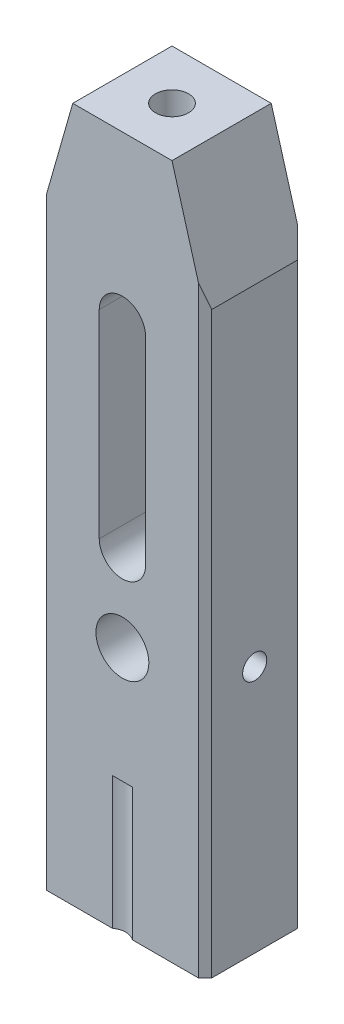
ISO-10303-21;
HEADER;
FILE_DESCRIPTION(('STEP AP214'),'2;1');
FILE_NAME('part.step','',(''),(''),'','','');
FILE_SCHEMA(('AUTOMOTIVE_DESIGN { 1 0 10303 214 1 1 1 1 }'));
ENDSEC;
DATA;
#1=APPLICATION_CONTEXT('core data for automotive mechanical design processes');
#2=APPLICATION_PROTOCOL_DEFINITION('international standard','automotive_design',2000,#1);
#3=PRODUCT_CONTEXT('',#1,'mechanical');
#4=PRODUCT('Part','Part','',(#3));
#5=PRODUCT_RELATED_PRODUCT_CATEGORY('part','',(#4));
#6=PRODUCT_DEFINITION_FORMATION('','',#4);
#7=PRODUCT_DEFINITION_CONTEXT('part definition',#1,'design');
#8=PRODUCT_DEFINITION('design','',#6,#7);
#9=PRODUCT_DEFINITION_SHAPE('','',#8);
#10=(LENGTH_UNIT() NAMED_UNIT(*) SI_UNIT(.MILLI.,.METRE.));
#11=(NAMED_UNIT(*) PLANE_ANGLE_UNIT() SI_UNIT($,.RADIAN.));
#12=(NAMED_UNIT(*) SI_UNIT($,.STERADIAN.) SOLID_ANGLE_UNIT());
#13=UNCERTAINTY_MEASURE_WITH_UNIT(LENGTH_MEASURE(1.E-05),#10,'distance_accuracy_value','');
#14=(GEOMETRIC_REPRESENTATION_CONTEXT(3) GLOBAL_UNCERTAINTY_ASSIGNED_CONTEXT((#13)) GLOBAL_UNIT_ASSIGNED_CONTEXT((#10,
#11,#12)) REPRESENTATION_CONTEXT('',''));
#15=CARTESIAN_POINT('',(0.,0.,0.));
#16=DIRECTION('',(0.,0.,1.));
#17=DIRECTION('',(1.,0.,0.));
#18=AXIS2_PLACEMENT_3D('',#15,#16,#17);
#19=CARTESIAN_POINT('',(0.,210.,0.));
#20=DIRECTION('',(0.,0.,-1.));
#21=DIRECTION('',(-1.,0.,0.));
#22=AXIS2_PLACEMENT_3D('',#19,#20,#21);
#23=PLANE('',#22);
#24=DIRECTION('',(0.,-1.,0.));
#25=VECTOR('',#24,1.);
#26=CARTESIAN_POINT('',(18.,160.,0.));
#27=LINE('',#26,#25);
#28=CARTESIAN_POINT('',(18.,160.,0.));
#29=VERTEX_POINT('',#28);
#30=CARTESIAN_POINT('',(18.,100.,0.));
#31=VERTEX_POINT('',#30);
#32=EDGE_CURVE('E206',#29,#31,#27,.T.);
#33=ORIENTED_EDGE('',*,*,#32,.F.);
#34=CARTESIAN_POINT('',(25.,160.,0.));
#35=DIRECTION('',(0.,0.,-1.));
#36=DIRECTION('',(-1.,0.,0.));
#37=AXIS2_PLACEMENT_3D('',#34,#35,#36);
#38=CIRCLE('',#37,7.);
#39=CARTESIAN_POINT('',(32.,160.,0.));
#40=VERTEX_POINT('',#39);
#41=EDGE_CURVE('E209',#40,#29,#38,.F.);
#42=ORIENTED_EDGE('',*,*,#41,.F.);
#43=DIRECTION('',(0.,1.,0.));
#44=VECTOR('',#43,1.);
#45=CARTESIAN_POINT('',(32.,160.,0.));
#46=LINE('',#45,#44);
#47=CARTESIAN_POINT('',(32.,100.,0.));
#48=VERTEX_POINT('',#47);
#49=EDGE_CURVE('E226',#48,#40,#46,.T.);
#50=ORIENTED_EDGE('',*,*,#49,.F.);
#51=CARTESIAN_POINT('',(25.,100.,0.));
#52=DIRECTION('',(0.,0.,-1.));
#53=DIRECTION('',(-1.,0.,0.));
#54=AXIS2_PLACEMENT_3D('',#51,#52,#53);
#55=CIRCLE('',#54,7.);
#56=EDGE_CURVE('E191',#31,#48,#55,.F.);
#57=ORIENTED_EDGE('',*,*,#56,.F.);
#58=EDGE_LOOP('',(#33,#42,#50,#57));
#59=FACE_BOUND('',#58,.T.);
#60=CARTESIAN_POINT('',(25.,75.,0.));
#61=DIRECTION('',(0.,0.,1.));
#62=DIRECTION('',(1.,0.,0.));
#63=AXIS2_PLACEMENT_3D('',#60,#61,#62);
#64=CIRCLE('',#63,8.);
#65=CARTESIAN_POINT('',(33.,75.,0.));
#66=VERTEX_POINT('',#65);
#67=EDGE_CURVE('E246',#66,#66,#64,.T.);
#68=ORIENTED_EDGE('',*,*,#67,.F.);
#69=EDGE_LOOP('',(#68));
#70=FACE_BOUND('',#69,.T.);
#71=DIRECTION('',(-1.,0.,0.));
#72=VECTOR('',#71,1.);
#73=CARTESIAN_POINT('',(22.,40.,0.));
#74=LINE('',#73,#72);
#75=CARTESIAN_POINT('',(28.,40.,0.));
#76=VERTEX_POINT('',#75);
#77=CARTESIAN_POINT('',(22.,40.,0.));
#78=VERTEX_POINT('',#77);
#79=EDGE_CURVE('E181',#76,#78,#74,.T.);
#80=ORIENTED_EDGE('',*,*,#79,.F.);
#81=DIRECTION('',(0.,-1.,0.));
#82=VECTOR('',#81,1.);
#83=CARTESIAN_POINT('',(28.,40.,0.));
#84=LINE('',#83,#82);
#85=CARTESIAN_POINT('',(28.,0.,0.));
#86=VERTEX_POINT('',#85);
#87=EDGE_CURVE('E172',#76,#86,#84,.T.);
#88=ORIENTED_EDGE('',*,*,#87,.T.);
#89=DIRECTION('',(1.,0.,0.));
#90=VECTOR('',#89,1.);
#91=CARTESIAN_POINT('',(0.,0.,0.));
#92=LINE('',#91,#90);
#93=CARTESIAN_POINT('',(48.,0.,0.));
#94=VERTEX_POINT('',#93);
#95=EDGE_CURVE('E274',#86,#94,#92,.T.);
#96=ORIENTED_EDGE('',*,*,#95,.T.);
#97=DIRECTION('',(0.,1.,0.));
#98=VECTOR('',#97,1.);
#99=CARTESIAN_POINT('',(48.,210.,0.));
#100=LINE('',#99,#98);
#101=CARTESIAN_POINT('',(48.,182.,0.));
#102=VERTEX_POINT('',#101);
#103=EDGE_CURVE('E11',#94,#102,#100,.T.);
#104=ORIENTED_EDGE('',*,*,#103,.T.);
#105=DIRECTION('',(-0.274721127897378,0.961523947640823,0.));
#106=VECTOR('',#105,1.);
#107=CARTESIAN_POINT('',(50.,175.,0.));
#108=LINE('',#107,#106);
#109=CARTESIAN_POINT('',(40.,210.,0.));
#110=VERTEX_POINT('',#109);
#111=EDGE_CURVE('E240',#102,#110,#108,.T.);
#112=ORIENTED_EDGE('',*,*,#111,.T.);
#113=DIRECTION('',(1.,0.,0.));
#114=VECTOR('',#113,1.);
#115=CARTESIAN_POINT('',(0.,210.,0.));
#116=LINE('',#115,#114);
#117=CARTESIAN_POINT('',(9.99999999999997,210.,0.));
#118=VERTEX_POINT('',#117);
#119=EDGE_CURVE('E264',#118,#110,#116,.T.);
#120=ORIENTED_EDGE('',*,*,#119,.F.);
#121=DIRECTION('',(0.274721127897377,0.961523947640823,0.));
#122=VECTOR('',#121,1.);
#123=CARTESIAN_POINT('',(0.,175.,0.));
#124=LINE('',#123,#122);
#125=CARTESIAN_POINT('',(2.00000000000003,182.,0.));
#126=VERTEX_POINT('',#125);
#127=EDGE_CURVE('E239',#126,#118,#124,.T.);
#128=ORIENTED_EDGE('',*,*,#127,.F.);
#129=DIRECTION('',(0.,-1.,0.));
#130=VECTOR('',#129,1.);
#131=CARTESIAN_POINT('',(2.00000000000003,210.,0.));
#132=LINE('',#131,#130);
#133=CARTESIAN_POINT('',(2.00000000000003,0.,0.));
#134=VERTEX_POINT('',#133);
#135=EDGE_CURVE('E57',#126,#134,#132,.T.);
#136=ORIENTED_EDGE('',*,*,#135,.T.);
#137=CARTESIAN_POINT('',(22.,0.,0.));
#138=VERTEX_POINT('',#137);
#139=EDGE_CURVE('E275',#134,#138,#92,.T.);
#140=ORIENTED_EDGE('',*,*,#139,.T.);
#141=DIRECTION('',(0.,-1.,0.));
#142=VECTOR('',#141,1.);
#143=CARTESIAN_POINT('',(22.,40.,0.));
#144=LINE('',#143,#142);
#145=EDGE_CURVE('E65',#78,#138,#144,.T.);
#146=ORIENTED_EDGE('',*,*,#145,.F.);
#147=EDGE_LOOP('',(#80,#88,#96,#104,#112,#120,#128,#136,#140,#146));
#148=FACE_BOUND('',#147,.T.);
#149=ADVANCED_FACE('F42',(#59,#70,#148),#23,.F.);
#150=CARTESIAN_POINT('',(50.,210.,0.));
#151=DIRECTION('',(-1.,0.,0.));
#152=DIRECTION('',(0.,0.,1.));
#153=AXIS2_PLACEMENT_3D('',#150,#151,#152);
#154=PLANE('',#153);
#155=CARTESIAN_POINT('',(50.,75.,-15.));
#156=DIRECTION('',(1.,0.,0.));
#157=DIRECTION('',(0.,0.,-1.));
#158=AXIS2_PLACEMENT_3D('',#155,#156,#157);
#159=CIRCLE('',#158,3.65);
#160=CARTESIAN_POINT('',(50.,75.,-18.65));
#161=VERTEX_POINT('',#160);
#162=EDGE_CURVE('E477',#161,#161,#159,.T.);
#163=ORIENTED_EDGE('',*,*,#162,.F.);
#164=EDGE_LOOP('',(#163));
#165=FACE_BOUND('',#164,.T.);
#166=DIRECTION('',(0.,0.,-1.));
#167=VECTOR('',#166,1.);
#168=CARTESIAN_POINT('',(50.,0.,0.));
#169=LINE('',#168,#167);
#170=CARTESIAN_POINT('',(50.,0.,-2.00000000000003));
#171=VERTEX_POINT('',#170);
#172=CARTESIAN_POINT('',(50.,0.,-28.));
#173=VERTEX_POINT('',#172);
#174=EDGE_CURVE('E277',#171,#173,#169,.T.);
#175=ORIENTED_EDGE('',*,*,#174,.T.);
#176=DIRECTION('',(0.,1.,0.));
#177=VECTOR('',#176,1.);
#178=CARTESIAN_POINT('',(50.,210.,-28.));
#179=LINE('',#178,#177);
#180=CARTESIAN_POINT('',(50.,175.,-28.));
#181=VERTEX_POINT('',#180);
#182=EDGE_CURVE('E309',#173,#181,#179,.T.);
#183=ORIENTED_EDGE('',*,*,#182,.T.);
#184=DIRECTION('',(0.,0.,1.));
#185=VECTOR('',#184,1.);
#186=CARTESIAN_POINT('',(50.,175.,-30.001));
#187=LINE('',#186,#185);
#188=CARTESIAN_POINT('',(50.,175.,-2.00000000000003));
#189=VERTEX_POINT('',#188);
#190=EDGE_CURVE('E251',#181,#189,#187,.T.);
#191=ORIENTED_EDGE('',*,*,#190,.T.);
#192=DIRECTION('',(0.,-1.,0.));
#193=VECTOR('',#192,1.);
#194=CARTESIAN_POINT('',(50.,210.,-2.00000000000003));
#195=LINE('',#194,#193);
#196=EDGE_CURVE('E306',#189,#171,#195,.T.);
#197=ORIENTED_EDGE('',*,*,#196,.T.);
#198=EDGE_LOOP('',(#175,#183,#191,#197));
#199=FACE_BOUND('',#198,.T.);
#200=ADVANCED_FACE('F377',(#165,#199),#154,.F.);
#201=CARTESIAN_POINT('',(0.,210.,-30.));
#202=DIRECTION('',(0.,0.,1.));
#203=DIRECTION('',(1.,0.,0.));
#204=AXIS2_PLACEMENT_3D('',#201,#202,#203);
#205=PLANE('',#204);
#206=DIRECTION('',(0.,-1.,0.));
#207=VECTOR('',#206,1.);
#208=CARTESIAN_POINT('',(32.,160.,-30.));
#209=LINE('',#208,#207);
#210=CARTESIAN_POINT('',(32.,160.,-30.));
#211=VERTEX_POINT('',#210);
#212=CARTESIAN_POINT('',(32.,100.,-30.));
#213=VERTEX_POINT('',#212);
#214=EDGE_CURVE('E214',#211,#213,#209,.T.);
#215=ORIENTED_EDGE('',*,*,#214,.F.);
#216=CARTESIAN_POINT('',(25.,160.,-30.));
#217=DIRECTION('',(0.,0.,-1.));
#218=DIRECTION('',(-1.,0.,0.));
#219=AXIS2_PLACEMENT_3D('',#216,#217,#218);
#220=CIRCLE('',#219,7.);
#221=CARTESIAN_POINT('',(18.,160.,-30.));
#222=VERTEX_POINT('',#221);
#223=EDGE_CURVE('E212',#222,#211,#220,.T.);
#224=ORIENTED_EDGE('',*,*,#223,.F.);
#225=DIRECTION('',(0.,1.,0.));
#226=VECTOR('',#225,1.);
#227=CARTESIAN_POINT('',(18.,160.,-30.));
#228=LINE('',#227,#226);
#229=CARTESIAN_POINT('',(18.,100.,-30.));
#230=VERTEX_POINT('',#229);
#231=EDGE_CURVE('E220',#230,#222,#228,.T.);
#232=ORIENTED_EDGE('',*,*,#231,.F.);
#233=CARTESIAN_POINT('',(25.,100.,-30.));
#234=DIRECTION('',(0.,0.,-1.));
#235=DIRECTION('',(-1.,0.,0.));
#236=AXIS2_PLACEMENT_3D('',#233,#234,#235);
#237=CIRCLE('',#236,7.);
#238=EDGE_CURVE('E217',#213,#230,#237,.T.);
#239=ORIENTED_EDGE('',*,*,#238,.F.);
#240=EDGE_LOOP('',(#215,#224,#232,#239));
#241=FACE_BOUND('',#240,.T.);
#242=CARTESIAN_POINT('',(25.,75.,-30.));
#243=DIRECTION('',(0.,0.,1.));
#244=DIRECTION('',(1.,0.,0.));
#245=AXIS2_PLACEMENT_3D('',#242,#243,#244);
#246=CIRCLE('',#245,8.);
#247=CARTESIAN_POINT('',(33.,75.,-30.));
#248=VERTEX_POINT('',#247);
#249=EDGE_CURVE('E260',#248,#248,#246,.F.);
#250=ORIENTED_EDGE('',*,*,#249,.F.);
#251=EDGE_LOOP('',(#250));
#252=FACE_BOUND('',#251,.T.);
#253=DIRECTION('',(1.,0.,0.));
#254=VECTOR('',#253,1.);
#255=CARTESIAN_POINT('',(22.,40.,-30.));
#256=LINE('',#255,#254);
#257=CARTESIAN_POINT('',(22.,40.,-30.));
#258=VERTEX_POINT('',#257);
#259=CARTESIAN_POINT('',(28.,40.,-30.));
#260=VERTEX_POINT('',#259);
#261=EDGE_CURVE('E196',#258,#260,#256,.T.);
#262=ORIENTED_EDGE('',*,*,#261,.F.);
#263=DIRECTION('',(0.,-1.,0.));
#264=VECTOR('',#263,1.);
#265=CARTESIAN_POINT('',(22.,40.,-30.));
#266=LINE('',#265,#264);
#267=CARTESIAN_POINT('',(22.,0.,-30.));
#268=VERTEX_POINT('',#267);
#269=EDGE_CURVE('E200',#258,#268,#266,.T.);
#270=ORIENTED_EDGE('',*,*,#269,.T.);
#271=DIRECTION('',(-1.,0.,0.));
#272=VECTOR('',#271,1.);
#273=CARTESIAN_POINT('',(0.,0.,-30.));
#274=LINE('',#273,#272);
#275=CARTESIAN_POINT('',(2.00000000000003,0.,-30.));
#276=VERTEX_POINT('',#275);
#277=EDGE_CURVE('E280',#268,#276,#274,.T.);
#278=ORIENTED_EDGE('',*,*,#277,.T.);
#279=DIRECTION('',(0.,1.,0.));
#280=VECTOR('',#279,1.);
#281=CARTESIAN_POINT('',(2.00000000000003,210.,-30.));
#282=LINE('',#281,#280);
#283=CARTESIAN_POINT('',(2.00000000000003,182.,-30.));
#284=VERTEX_POINT('',#283);
#285=EDGE_CURVE('E300',#276,#284,#282,.T.);
#286=ORIENTED_EDGE('',*,*,#285,.T.);
#287=DIRECTION('',(-0.274721127897377,-0.961523947640823,0.));
#288=VECTOR('',#287,1.);
#289=CARTESIAN_POINT('',(0.,175.,-30.));
#290=LINE('',#289,#288);
#291=CARTESIAN_POINT('',(9.99999999999997,210.,-30.));
#292=VERTEX_POINT('',#291);
#293=EDGE_CURVE('E236',#292,#284,#290,.T.);
#294=ORIENTED_EDGE('',*,*,#293,.F.);
#295=DIRECTION('',(-1.,0.,0.));
#296=VECTOR('',#295,1.);
#297=CARTESIAN_POINT('',(0.,210.,-30.));
#298=LINE('',#297,#296);
#299=CARTESIAN_POINT('',(40.,210.,-30.));
#300=VERTEX_POINT('',#299);
#301=EDGE_CURVE('E267',#300,#292,#298,.T.);
#302=ORIENTED_EDGE('',*,*,#301,.F.);
#303=DIRECTION('',(0.274721127897378,-0.961523947640823,0.));
#304=VECTOR('',#303,1.);
#305=CARTESIAN_POINT('',(50.,175.,-30.));
#306=LINE('',#305,#304);
#307=CARTESIAN_POINT('',(48.,182.,-30.));
#308=VERTEX_POINT('',#307);
#309=EDGE_CURVE('E235',#300,#308,#306,.T.);
#310=ORIENTED_EDGE('',*,*,#309,.T.);
#311=DIRECTION('',(0.,-1.,0.));
#312=VECTOR('',#311,1.);
#313=CARTESIAN_POINT('',(48.,210.,-30.));
#314=LINE('',#313,#312);
#315=CARTESIAN_POINT('',(48.,0.,-30.));
#316=VERTEX_POINT('',#315);
#317=EDGE_CURVE('E297',#308,#316,#314,.T.);
#318=ORIENTED_EDGE('',*,*,#317,.T.);
#319=CARTESIAN_POINT('',(28.,0.,-30.));
#320=VERTEX_POINT('',#319);
#321=EDGE_CURVE('E268',#316,#320,#274,.T.);
#322=ORIENTED_EDGE('',*,*,#321,.T.);
#323=DIRECTION('',(0.,-1.,0.));
#324=VECTOR('',#323,1.);
#325=CARTESIAN_POINT('',(28.,40.,-30.));
#326=LINE('',#325,#324);
#327=EDGE_CURVE('E73',#260,#320,#326,.T.);
#328=ORIENTED_EDGE('',*,*,#327,.F.);
#329=EDGE_LOOP('',(#262,#270,#278,#286,#294,#302,#310,#318,#322,#328));
#330=FACE_BOUND('',#329,.T.);
#331=ADVANCED_FACE('F383',(#241,#252,#330),#205,.F.);
#332=CARTESIAN_POINT('',(0.,210.,0.));
#333=DIRECTION('',(0.,-1.,0.));
#334=DIRECTION('',(0.,0.,-1.));
#335=AXIS2_PLACEMENT_3D('',#332,#333,#334);
#336=PLANE('',#335);
#337=CARTESIAN_POINT('',(25.,210.,-15.));
#338=DIRECTION('',(0.,1.,0.));
#339=DIRECTION('',(0.,0.,1.));
#340=AXIS2_PLACEMENT_3D('',#337,#338,#339);
#341=CIRCLE('',#340,5.);
#342=CARTESIAN_POINT('',(25.,210.,-10.));
#343=VERTEX_POINT('',#342);
#344=EDGE_CURVE('E472',#343,#343,#341,.T.);
#345=ORIENTED_EDGE('',*,*,#344,.F.);
#346=EDGE_LOOP('',(#345));
#347=FACE_BOUND('',#346,.T.);
#348=ORIENTED_EDGE('',*,*,#301,.T.);
#349=DIRECTION('',(0.,0.,1.));
#350=VECTOR('',#349,1.);
#351=CARTESIAN_POINT('',(9.99999999999997,210.,-30.001));
#352=LINE('',#351,#350);
#353=EDGE_CURVE('E242',#292,#118,#352,.T.);
#354=ORIENTED_EDGE('',*,*,#353,.T.);
#355=ORIENTED_EDGE('',*,*,#119,.T.);
#356=DIRECTION('',(0.,0.,1.));
#357=VECTOR('',#356,1.);
#358=CARTESIAN_POINT('',(40.,210.,-30.001));
#359=LINE('',#358,#357);
#360=EDGE_CURVE('E254',#300,#110,#359,.T.);
#361=ORIENTED_EDGE('',*,*,#360,.F.);
#362=EDGE_LOOP('',(#348,#354,#355,#361));
#363=FACE_BOUND('',#362,.T.);
#364=ADVANCED_FACE('F393',(#347,#363),#336,.F.);
#365=CARTESIAN_POINT('',(0.,210.,0.));
#366=DIRECTION('',(1.,0.,0.));
#367=DIRECTION('',(0.,0.,-1.));
#368=AXIS2_PLACEMENT_3D('',#365,#366,#367);
#369=PLANE('',#368);
#370=CARTESIAN_POINT('',(0.,75.,-15.));
#371=DIRECTION('',(1.,0.,0.));
#372=DIRECTION('',(0.,0.,-1.));
#373=AXIS2_PLACEMENT_3D('',#370,#371,#372);
#374=CIRCLE('',#373,3.65);
#375=CARTESIAN_POINT('',(0.,75.,-18.65));
#376=VERTEX_POINT('',#375);
#377=EDGE_CURVE('E321',#376,#376,#374,.F.);
#378=ORIENTED_EDGE('',*,*,#377,.F.);
#379=EDGE_LOOP('',(#378));
#380=FACE_BOUND('',#379,.T.);
#381=DIRECTION('',(0.,0.,1.));
#382=VECTOR('',#381,1.);
#383=CARTESIAN_POINT('',(0.,175.,-30.001));
#384=LINE('',#383,#382);
#385=CARTESIAN_POINT('',(0.,175.,-28.));
#386=VERTEX_POINT('',#385);
#387=CARTESIAN_POINT('',(0.,175.,-2.00000000000003));
#388=VERTEX_POINT('',#387);
#389=EDGE_CURVE('E243',#386,#388,#384,.T.);
#390=ORIENTED_EDGE('',*,*,#389,.F.);
#391=DIRECTION('',(0.,-1.,0.));
#392=VECTOR('',#391,1.);
#393=CARTESIAN_POINT('',(0.,210.,-28.));
#394=LINE('',#393,#392);
#395=CARTESIAN_POINT('',(0.,0.,-28.));
#396=VERTEX_POINT('',#395);
#397=EDGE_CURVE('E284',#386,#396,#394,.T.);
#398=ORIENTED_EDGE('',*,*,#397,.T.);
#399=DIRECTION('',(0.,0.,1.));
#400=VECTOR('',#399,1.);
#401=CARTESIAN_POINT('',(0.,0.,0.));
#402=LINE('',#401,#400);
#403=CARTESIAN_POINT('',(0.,0.,-2.00000000000003));
#404=VERTEX_POINT('',#403);
#405=EDGE_CURVE('E263',#396,#404,#402,.T.);
#406=ORIENTED_EDGE('',*,*,#405,.T.);
#407=DIRECTION('',(0.,1.,0.));
#408=VECTOR('',#407,1.);
#409=CARTESIAN_POINT('',(0.,210.,-2.00000000000003));
#410=LINE('',#409,#408);
#411=EDGE_CURVE('E271',#404,#388,#410,.T.);
#412=ORIENTED_EDGE('',*,*,#411,.T.);
#413=EDGE_LOOP('',(#390,#398,#406,#412));
#414=FACE_BOUND('',#413,.T.);
#415=ADVANCED_FACE('F390',(#380,#414),#369,.F.);
#416=CARTESIAN_POINT('',(0.,0.,0.));
#417=DIRECTION('',(0.,-1.,0.));
#418=DIRECTION('',(0.,0.,-1.));
#419=AXIS2_PLACEMENT_3D('',#416,#417,#418);
#420=PLANE('',#419);
#421=CARTESIAN_POINT('',(25.,0.,4.));
#422=DIRECTION('',(0.,-1.,0.));
#423=DIRECTION('',(0.,0.,-1.));
#424=AXIS2_PLACEMENT_3D('',#421,#422,#423);
#425=CIRCLE('',#424,5.);
#426=EDGE_CURVE('E177',#138,#86,#425,.T.);
#427=ORIENTED_EDGE('',*,*,#426,.F.);
#428=ORIENTED_EDGE('',*,*,#139,.F.);
#429=DIRECTION('',(0.707106781186548,0.,0.707106781186548));
#430=VECTOR('',#429,1.);
#431=CARTESIAN_POINT('',(1.00000000000001,0.,-1.00000000000001));
#432=LINE('',#431,#430);
#433=EDGE_CURVE('E287',#134,#404,#432,.F.);
#434=ORIENTED_EDGE('',*,*,#433,.T.);
#435=ORIENTED_EDGE('',*,*,#405,.F.);
#436=DIRECTION('',(-0.707106781186548,0.,0.707106781186548));
#437=VECTOR('',#436,1.);
#438=CARTESIAN_POINT('',(-14.,0.,-14.));
#439=LINE('',#438,#437);
#440=EDGE_CURVE('E294',#396,#276,#439,.F.);
#441=ORIENTED_EDGE('',*,*,#440,.T.);
#442=ORIENTED_EDGE('',*,*,#277,.F.);
#443=CARTESIAN_POINT('',(25.,0.,-34.));
#444=DIRECTION('',(0.,-1.,0.));
#445=DIRECTION('',(0.,0.,1.));
#446=AXIS2_PLACEMENT_3D('',#443,#444,#445);
#447=CIRCLE('',#446,5.);
#448=EDGE_CURVE('E197',#320,#268,#447,.T.);
#449=ORIENTED_EDGE('',*,*,#448,.F.);
#450=ORIENTED_EDGE('',*,*,#321,.F.);
#451=DIRECTION('',(-0.707106781186548,0.,-0.707106781186548));
#452=VECTOR('',#451,1.);
#453=CARTESIAN_POINT('',(39.,0.,-39.));
#454=LINE('',#453,#452);
#455=EDGE_CURVE('E292',#316,#173,#454,.F.);
#456=ORIENTED_EDGE('',*,*,#455,.T.);
#457=ORIENTED_EDGE('',*,*,#174,.F.);
#458=DIRECTION('',(0.707106781186548,0.,-0.707106781186548));
#459=VECTOR('',#458,1.);
#460=CARTESIAN_POINT('',(24.,0.,24.));
#461=LINE('',#460,#459);
#462=EDGE_CURVE('E289',#171,#94,#461,.F.);
#463=ORIENTED_EDGE('',*,*,#462,.T.);
#464=ORIENTED_EDGE('',*,*,#95,.F.);
#465=EDGE_LOOP('',(#427,#428,#434,#435,#441,#442,#449,#450,#456,#457,#463,#464));
#466=FACE_BOUND('',#465,.T.);
#467=ADVANCED_FACE('F373',(#466),#420,.T.);
#468=CARTESIAN_POINT('',(25.,75.,-30.001));
#469=DIRECTION('',(0.,0.,1.));
#470=DIRECTION('',(1.,0.,0.));
#471=AXIS2_PLACEMENT_3D('',#468,#469,#470);
#472=CYLINDRICAL_SURFACE('',#471,8.);
#473=CARTESIAN_POINT('',(33.,75.,-18.65));
#474=CARTESIAN_POINT('',(32.999999376249,75.0969672300422,-18.649999252409));
#475=CARTESIAN_POINT('',(32.9982323240076,75.1939558002816,-18.6461307331599));
#476=CARTESIAN_POINT('',(32.9912086624189,75.3872300149117,-18.6306970823399));
#477=CARTESIAN_POINT('',(32.9859501554252,75.4835152482431,-18.6191277652868));
#478=CARTESIAN_POINT('',(32.9720666311262,75.6748026120968,-18.5883891266279));
#479=CARTESIAN_POINT('',(32.9634356063241,75.769802138188,-18.5692062419395));
#480=CARTESIAN_POINT('',(32.943035638054,75.9576736421452,-18.5234538684936));
#481=CARTESIAN_POINT('',(32.9312654117875,76.0505447333653,-18.4968813598617));
#482=CARTESIAN_POINT('',(32.8917736381262,76.3242604588947,-18.4066930280543));
#483=CARTESIAN_POINT('',(32.8598002427291,76.5011242984846,-18.3324564267251));
#484=CARTESIAN_POINT('',(32.787552400533,76.8395874844289,-18.1582788744027));
#485=CARTESIAN_POINT('',(32.7472795801514,77.0011898125085,-18.0583429586896));
#486=CARTESIAN_POINT('',(32.6597528402002,77.3142962421895,-17.8294984457067));
#487=CARTESIAN_POINT('',(32.6122423778815,77.4648144929931,-17.6993372443307));
#488=CARTESIAN_POINT('',(32.5165813608976,77.7427465815881,-17.4164527970321));
#489=CARTESIAN_POINT('',(32.4684304242096,77.8701458993089,-17.2637154804659));
#490=CARTESIAN_POINT('',(32.3735521598887,78.106108289656,-16.9284824075001));
#491=CARTESIAN_POINT('',(32.3270955267186,78.2130262708926,-16.7447326733022));
#492=CARTESIAN_POINT('',(32.2655783568074,78.3487065616955,-16.4560285610487));
#493=CARTESIAN_POINT('',(32.2464284666962,78.3898276433709,-16.3575758461442));
#494=CARTESIAN_POINT('',(32.2115361327019,78.4634387051435,-16.1569301450262));
#495=CARTESIAN_POINT('',(32.1957918235348,78.4959334122538,-16.0547392423134));
#496=CARTESIAN_POINT('',(32.1690737026448,78.5503876934218,-15.8529797464119));
#497=CARTESIAN_POINT('',(32.1578885640982,78.5728205642745,-15.7535665262265));
#498=CARTESIAN_POINT('',(32.1395528819805,78.6093217414679,-15.5528912442376));
#499=CARTESIAN_POINT('',(32.1324003578249,78.6233941541593,-15.451630115292));
#500=CARTESIAN_POINT('',(32.1224106848553,78.6429916143469,-15.2481111688566));
#501=CARTESIAN_POINT('',(32.1195718357818,78.6485200295228,-15.1458537600592));
#502=CARTESIAN_POINT('',(32.1183205920222,78.6509607204252,-14.9412139217119));
#503=CARTESIAN_POINT('',(32.1199078879722,78.6478735983316,-14.8388315013997));
#504=CARTESIAN_POINT('',(32.1270822668351,78.6338344745467,-14.6446188055017));
#505=CARTESIAN_POINT('',(32.1322719341171,78.6236636093027,-14.5527165656827));
#506=CARTESIAN_POINT('',(32.1460382671809,78.5964373451907,-14.3701844529465));
#507=CARTESIAN_POINT('',(32.1546160745523,78.579379625844,-14.2795550195541));
#508=CARTESIAN_POINT('',(32.1850490521893,78.518125850815,-14.0105351130803));
#509=CARTESIAN_POINT('',(32.2116100344137,78.4638379268713,-13.834861897541));
#510=CARTESIAN_POINT('',(32.2749073555619,78.3288650662013,-13.4913380549506));
#511=CARTESIAN_POINT('',(32.3118619997622,78.2476061927846,-13.3237573073426));
#512=CARTESIAN_POINT('',(32.3917580083566,78.0613999609972,-13.0038536391885));
#513=CARTESIAN_POINT('',(32.4347019451476,77.9564424120084,-12.8515373232715));
#514=CARTESIAN_POINT('',(32.527115926956,77.7131398039364,-12.5499630545587));
#515=CARTESIAN_POINT('',(32.5768019892095,77.5724664063735,-12.4026446099102));
#516=CARTESIAN_POINT('',(32.673429968881,77.2680320418328,-12.1329638615159));
#517=CARTESIAN_POINT('',(32.7203709629875,77.1042633691641,-12.0106099205994));
#518=CARTESIAN_POINT('',(32.8081181739056,76.7513890966661,-11.7906816218314));
#519=CARTESIAN_POINT('',(32.8486739430789,76.5616306569792,-11.6940471305481));
#520=CARTESIAN_POINT('',(32.9170739016543,76.166224737481,-11.5347783002999));
#521=CARTESIAN_POINT('',(32.9449265362468,75.9605879204538,-11.4721213674096));
#522=CARTESIAN_POINT('',(32.9831064739478,75.5553267087164,-11.3869931497886));
#523=CARTESIAN_POINT('',(32.9945614664067,75.3563534925476,-11.3619296675027));
#524=CARTESIAN_POINT('',(33.0023751759205,74.9567249327567,-11.3447869891222));
#525=CARTESIAN_POINT('',(32.9987393974773,74.7560702291212,-11.3526957660879));
#526=CARTESIAN_POINT('',(32.9774850656181,74.3719241107118,-11.3995629440113));
#527=CARTESIAN_POINT('',(32.9607467016684,74.1881395050002,-11.4365674614321));
#528=CARTESIAN_POINT('',(32.9159942208297,73.8296653261356,-11.5377010950703));
#529=CARTESIAN_POINT('',(32.8879787599825,73.6549768398243,-11.6018334443175));
#530=CARTESIAN_POINT('',(32.8222031032846,73.3134863473153,-11.7573971543703));
#531=CARTESIAN_POINT('',(32.7841678931589,73.1470963479273,-11.8496127174875));
#532=CARTESIAN_POINT('',(32.7022378668129,72.8315560327416,-12.0578702858139));
#533=CARTESIAN_POINT('',(32.6583404821865,72.6824133272859,-12.1739227467909));
#534=CARTESIAN_POINT('',(32.5647261280846,72.392305404805,-12.4379554969642));
#535=CARTESIAN_POINT('',(32.5148307598654,72.2530943852772,-12.5878044103932));
#536=CARTESIAN_POINT('',(32.417899485596,72.0011621900057,-12.9092596016835));
#537=CARTESIAN_POINT('',(32.3708647796926,71.8884520762495,-13.08087491941));
#538=CARTESIAN_POINT('',(32.2839299625728,71.6899435834918,-13.4473778079726));
#539=CARTESIAN_POINT('',(32.244267112592,71.6049891973405,-13.6427833179692));
#540=CARTESIAN_POINT('',(32.1794856831053,71.4700302917698,-14.0475316083596));
#541=CARTESIAN_POINT('',(32.1543518877445,71.4199891972679,-14.2568595509922));
#542=CARTESIAN_POINT('',(32.1241192359954,71.3602274195256,-14.6637512928223));
#543=CARTESIAN_POINT('',(32.1174560588551,71.3473543704112,-14.8607358983275));
#544=CARTESIAN_POINT('',(32.1206327869485,71.3535480132086,-15.2540421494298));
#545=CARTESIAN_POINT('',(32.1304686243253,71.372606832269,-15.4503639464859));
#546=CARTESIAN_POINT('',(32.1639922011563,71.4393192929843,-15.8231183317288));
#547=CARTESIAN_POINT('',(32.186711996529,71.4849803280036,-16.0000040064702));
#548=CARTESIAN_POINT('',(32.242503096993,71.6014278575693,-16.3435506089466));
#549=CARTESIAN_POINT('',(32.2755774381349,71.6722217221152,-16.5102085206413));
#550=CARTESIAN_POINT('',(32.3510172770853,71.8421975026271,-16.8405200300795));
#551=CARTESIAN_POINT('',(32.3938487336217,71.942932358138,-17.0032654148711));
#552=CARTESIAN_POINT('',(32.4829365766255,72.1679880179681,-17.3105196055214));
#553=CARTESIAN_POINT('',(32.5291944812247,72.2923193155671,-17.4550202501994));
#554=CARTESIAN_POINT('',(32.6251433548235,72.5748234448443,-17.7357503124363));
#555=CARTESIAN_POINT('',(32.6747472946373,72.735080775,-17.8699186841057));
#556=CARTESIAN_POINT('',(32.7676179023913,73.0776340605656,-18.1097671665824));
#557=CARTESIAN_POINT('',(32.8108816211862,73.2599402004386,-18.2154340390433));
#558=CARTESIAN_POINT('',(32.8672524077084,73.5454451791164,-18.3492912541582));
#559=CARTESIAN_POINT('',(32.8845748667778,73.6422530318346,-18.3897018890259));
#560=CARTESIAN_POINT('',(32.9159982670922,73.8394362905937,-18.4621672975981));
#561=CARTESIAN_POINT('',(32.9301007674502,73.939809942741,-18.4942261163399));
#562=CARTESIAN_POINT('',(32.9546357576577,74.1431231446246,-18.5495551468391));
#563=CARTESIAN_POINT('',(32.9650768727688,74.2460560438659,-18.5728460232218));
#564=CARTESIAN_POINT('',(32.982013034458,74.4538195350433,-18.610445458084));
#565=CARTESIAN_POINT('',(32.9885107548558,74.558648791377,-18.6247601031183));
#566=CARTESIAN_POINT('',(32.9952864316778,74.7197784991694,-18.6396597104699));
#567=CARTESIAN_POINT('',(32.9970523232468,74.7757340386946,-18.6435355002573));
#568=CARTESIAN_POINT('',(32.9994092973007,74.8877906689344,-18.6487058820351));
#569=CARTESIAN_POINT('',(33.0000003609216,74.9438917619715,-18.6500004325793));
#570=CARTESIAN_POINT('',(33.,75.,-18.65));
#571=B_SPLINE_CURVE_WITH_KNOTS('',3,(#473,#474,#475,#476,#477,#478,#479,#480,#481,#482,#483,
#484,#485,#486,#487,#488,#489,#490,#491,#492,#493,#494,#495,#496,#497,#498,#499,#500,#501,#502,
#503,#504,#505,#506,#507,#508,#509,#510,#511,#512,#513,#514,#515,#516,#517,#518,#519,#520,#521,
#522,#523,#524,#525,#526,#527,#528,#529,#530,#531,#532,#533,#534,#535,#536,#537,#538,#539,#540,
#541,#542,#543,#544,#545,#546,#547,#548,#549,#550,#551,#552,#553,#554,#555,#556,#557,#558,#559,
#560,#561,#562,#563,#564,#565,#566,#567,#568,#569,#570),.UNSPECIFIED.,.T.,.F.,(4,2,2,2,2,2,2,2,
2,2,2,2,2,2,2,2,2,2,2,2,2,2,2,2,2,2,2,2,2,2,2,2,2,2,2,2,2,2,2,2,2,2,2,2,2,2,2,2,4),(0.,
0.290845353036157,0.58184891345919,0.873373221785264,1.16501684115914,1.74554460495659,
2.32595871218971,2.93706445343841,3.54855268715393,4.19773257512988,4.52255828351775,
4.84720562731734,5.15436107706835,5.46136553832032,5.76824896061142,6.07511093393117,
6.35259917276549,6.63018098750374,7.18489520983742,7.75226400859757,8.31987724663672,
8.94609580397706,9.57252379435249,10.2194119440437,10.8658694058988,11.465290691481,
12.0644933516795,12.6265752760012,13.188724206782,13.7682892494611,14.3481090563484,
14.9768938167007,15.6059405797757,16.2526403960946,16.8986617098099,17.4880034745766,
18.0771999576042,18.6270867910529,19.177135007755,19.7631321597909,20.3493905165257,
20.9908686227268,21.6326441709215,21.9512570305167,22.2697152881544,22.587418220887,
22.9049054937033,23.0731949072494,23.2414870229522),.UNSPECIFIED.);
#572=CARTESIAN_POINT('',(33.,75.,-18.65));
#573=VERTEX_POINT('',#572);
#574=EDGE_CURVE('E47',#573,#573,#571,.T.);
#575=ORIENTED_EDGE('',*,*,#574,.T.);
#576=EDGE_LOOP('',(#575));
#577=FACE_BOUND('',#576,.T.);
#578=CARTESIAN_POINT('',(17.,75.,-18.65));
#579=CARTESIAN_POINT('',(17.000000623751,74.9030327699578,-18.649999252409));
#580=CARTESIAN_POINT('',(17.0017676759924,74.8060441997184,-18.6461307331599));
#581=CARTESIAN_POINT('',(17.0087913375811,74.6127699850883,-18.6306970823399));
#582=CARTESIAN_POINT('',(17.0140498445748,74.5164847517569,-18.6191277652868));
#583=CARTESIAN_POINT('',(17.0279333688738,74.3251973879032,-18.5883891266279));
#584=CARTESIAN_POINT('',(17.0365643936759,74.230197861812,-18.5692062419395));
#585=CARTESIAN_POINT('',(17.056964361946,74.0423263578548,-18.5234538684936));
#586=CARTESIAN_POINT('',(17.0687345882125,73.9494552666348,-18.4968813598617));
#587=CARTESIAN_POINT('',(17.1082263618738,73.6757395411053,-18.4066930280543));
#588=CARTESIAN_POINT('',(17.1401997572709,73.4988757015154,-18.3324564267251));
#589=CARTESIAN_POINT('',(17.212447599467,73.1604125155711,-18.1582788744027));
#590=CARTESIAN_POINT('',(17.2527204198486,72.9988101874915,-18.0583429586896));
#591=CARTESIAN_POINT('',(17.3402471597998,72.6857037578106,-17.8294984457068));
#592=CARTESIAN_POINT('',(17.3877576221185,72.5351855070069,-17.6993372443307));
#593=CARTESIAN_POINT('',(17.4834186391024,72.2572534184119,-17.4164527970321));
#594=CARTESIAN_POINT('',(17.5315695757904,72.1298541006911,-17.263715480466));
#595=CARTESIAN_POINT('',(17.6264478401113,71.893891710344,-16.9284824075001));
#596=CARTESIAN_POINT('',(17.6729044732814,71.7869737291074,-16.7447326733023));
#597=CARTESIAN_POINT('',(17.7344216431926,71.6512934383045,-16.4560285610487));
#598=CARTESIAN_POINT('',(17.7535715333038,71.6101723566291,-16.3575758461442));
#599=CARTESIAN_POINT('',(17.7884638672981,71.5365612948565,-16.1569301450263));
#600=CARTESIAN_POINT('',(17.8042081764652,71.5040665877462,-16.0547392423135));
#601=CARTESIAN_POINT('',(17.8309262973552,71.4496123065782,-15.8529797464119));
#602=CARTESIAN_POINT('',(17.8421114359018,71.4271794357255,-15.7535665262265));
#603=CARTESIAN_POINT('',(17.8604471180195,71.3906782585321,-15.5528912442376));
#604=CARTESIAN_POINT('',(17.8675996421751,71.3766058458407,-15.451630115292));
#605=CARTESIAN_POINT('',(17.8775893151447,71.357008385653,-15.2481111688566));
#606=CARTESIAN_POINT('',(17.8804281642182,71.3514799704772,-15.1458537600592));
#607=CARTESIAN_POINT('',(17.8816794079778,71.3490392795748,-14.941213921712));
#608=CARTESIAN_POINT('',(17.8800921120278,71.3521264016684,-14.8388315013997));
#609=CARTESIAN_POINT('',(17.8729177331649,71.3661655254533,-14.6446188055017));
#610=CARTESIAN_POINT('',(17.8677280658829,71.3763363906972,-14.5527165656827));
#611=CARTESIAN_POINT('',(17.8539617328191,71.4035626548093,-14.3701844529465));
#612=CARTESIAN_POINT('',(17.8453839254477,71.420620374156,-14.2795550195541));
#613=CARTESIAN_POINT('',(17.8149509478107,71.481874149185,-14.0105351130803));
#614=CARTESIAN_POINT('',(17.7883899655863,71.5361620731287,-13.834861897541));
#615=CARTESIAN_POINT('',(17.7250926444381,71.6711349337987,-13.4913380549506));
#616=CARTESIAN_POINT('',(17.6881380002378,71.7523938072153,-13.3237573073426));
#617=CARTESIAN_POINT('',(17.6082419916434,71.9386000390028,-13.0038536391885));
#618=CARTESIAN_POINT('',(17.5652980548524,72.0435575879916,-12.8515373232715));
#619=CARTESIAN_POINT('',(17.472884073044,72.2868601960636,-12.5499630545587));
#620=CARTESIAN_POINT('',(17.4231980107905,72.4275335936264,-12.4026446099103));
#621=CARTESIAN_POINT('',(17.326570031119,72.7319679581672,-12.1329638615159));
#622=CARTESIAN_POINT('',(17.2796290370125,72.8957366308359,-12.0106099205995));
#623=CARTESIAN_POINT('',(17.1918818260944,73.2486109033339,-11.7906816218314));
#624=CARTESIAN_POINT('',(17.1513260569211,73.4383693430208,-11.6940471305481));
#625=CARTESIAN_POINT('',(17.0829260983457,73.8337752625189,-11.5347783002999));
#626=CARTESIAN_POINT('',(17.0550734637532,74.0394120795462,-11.4721213674096));
#627=CARTESIAN_POINT('',(17.0168935260522,74.4446732912836,-11.3869931497886));
#628=CARTESIAN_POINT('',(17.0054385335933,74.6436465074524,-11.3619296675027));
#629=CARTESIAN_POINT('',(16.9976248240795,75.0432750672433,-11.3447869891222));
#630=CARTESIAN_POINT('',(17.0012606025227,75.2439297708788,-11.3526957660879));
#631=CARTESIAN_POINT('',(17.0225149343819,75.6280758892881,-11.3995629440113));
#632=CARTESIAN_POINT('',(17.0392532983316,75.8118604949998,-11.4365674614321));
#633=CARTESIAN_POINT('',(17.0840057791703,76.1703346738644,-11.5377010950703));
#634=CARTESIAN_POINT('',(17.1120212400175,76.3450231601757,-11.6018334443175));
#635=CARTESIAN_POINT('',(17.1777968967154,76.6865136526847,-11.7573971543703));
#636=CARTESIAN_POINT('',(17.2158321068412,76.8529036520727,-11.8496127174875));
#637=CARTESIAN_POINT('',(17.2977621331871,77.1684439672584,-12.0578702858139));
#638=CARTESIAN_POINT('',(17.3416595178135,77.3175866727141,-12.1739227467909));
#639=CARTESIAN_POINT('',(17.4352738719154,77.6076945951949,-12.4379554969642));
#640=CARTESIAN_POINT('',(17.4851692401346,77.7469056147228,-12.5878044103932));
#641=CARTESIAN_POINT('',(17.582100514404,77.9988378099942,-12.9092596016835));
#642=CARTESIAN_POINT('',(17.6291352203074,78.1115479237504,-13.08087491941));
#643=CARTESIAN_POINT('',(17.7160700374271,78.3100564165081,-13.4473778079726));
#644=CARTESIAN_POINT('',(17.755732887408,78.3950108026595,-13.6427833179692));
#645=CARTESIAN_POINT('',(17.8205143168947,78.5299697082302,-14.0475316083595));
#646=CARTESIAN_POINT('',(17.8456481122555,78.5800108027321,-14.2568595509922));
#647=CARTESIAN_POINT('',(17.8758807640046,78.6397725804744,-14.6637512928223));
#648=CARTESIAN_POINT('',(17.8825439411449,78.6526456295887,-14.8607358983275));
#649=CARTESIAN_POINT('',(17.8793672130515,78.6464519867914,-15.2540421494298));
#650=CARTESIAN_POINT('',(17.8695313756747,78.627393167731,-15.4503639464858));
#651=CARTESIAN_POINT('',(17.8360077988437,78.5606807070157,-15.8231183317288));
#652=CARTESIAN_POINT('',(17.813288003471,78.5150196719964,-16.0000040064702));
#653=CARTESIAN_POINT('',(17.757496903007,78.3985721424307,-16.3435506089466));
#654=CARTESIAN_POINT('',(17.7244225618651,78.3277782778848,-16.5102085206413));
#655=CARTESIAN_POINT('',(17.6489827229147,78.1578024973729,-16.8405200300795));
#656=CARTESIAN_POINT('',(17.6061512663783,78.057067641862,-17.0032654148711));
#657=CARTESIAN_POINT('',(17.5170634233745,77.8320119820319,-17.3105196055214));
#658=CARTESIAN_POINT('',(17.4708055187753,77.7076806844329,-17.4550202501994));
#659=CARTESIAN_POINT('',(17.3748566451766,77.4251765551557,-17.7357503124363));
#660=CARTESIAN_POINT('',(17.3252527053627,77.264919225,-17.8699186841057));
#661=CARTESIAN_POINT('',(17.2323820976087,76.9223659394344,-18.1097671665824));
#662=CARTESIAN_POINT('',(17.1891183788138,76.7400597995614,-18.2154340390433));
#663=CARTESIAN_POINT('',(17.1327475922916,76.4545548208836,-18.3492912541582));
#664=CARTESIAN_POINT('',(17.1154251332222,76.3577469681654,-18.3897018890259));
#665=CARTESIAN_POINT('',(17.0840017329078,76.1605637094063,-18.4621672975981));
#666=CARTESIAN_POINT('',(17.0698992325498,76.060190057259,-18.4942261163399));
#667=CARTESIAN_POINT('',(17.0453642423423,75.8568768553754,-18.5495551468391));
#668=CARTESIAN_POINT('',(17.0349231272312,75.7539439561341,-18.5728460232218));
#669=CARTESIAN_POINT('',(17.017986965542,75.5461804649567,-18.610445458084));
#670=CARTESIAN_POINT('',(17.0114892451442,75.441351208623,-18.6247601031183));
#671=CARTESIAN_POINT('',(17.0047135683223,75.2802215008307,-18.6396597104698));
#672=CARTESIAN_POINT('',(17.0029476767532,75.2242659613054,-18.6435355002573));
#673=CARTESIAN_POINT('',(17.0005907026993,75.1122093310656,-18.6487058820351));
#674=CARTESIAN_POINT('',(16.9999996390783,75.0561082380285,-18.6500004325793));
#675=CARTESIAN_POINT('',(17.,75.,-18.65));
#676=B_SPLINE_CURVE_WITH_KNOTS('',3,(#578,#579,#580,#581,#582,#583,#584,#585,#586,#587,#588,
#589,#590,#591,#592,#593,#594,#595,#596,#597,#598,#599,#600,#601,#602,#603,#604,#605,#606,#607,
#608,#609,#610,#611,#612,#613,#614,#615,#616,#617,#618,#619,#620,#621,#622,#623,#624,#625,#626,
#627,#628,#629,#630,#631,#632,#633,#634,#635,#636,#637,#638,#639,#640,#641,#642,#643,#644,#645,
#646,#647,#648,#649,#650,#651,#652,#653,#654,#655,#656,#657,#658,#659,#660,#661,#662,#663,#664,
#665,#666,#667,#668,#669,#670,#671,#672,#673,#674,#675),.UNSPECIFIED.,.T.,.F.,(4,2,2,2,2,2,2,2,
2,2,2,2,2,2,2,2,2,2,2,2,2,2,2,2,2,2,2,2,2,2,2,2,2,2,2,2,2,2,2,2,2,2,2,2,2,2,2,2,4),(0.,
0.290845353036157,0.581848913459177,0.87337322178525,1.16501684115912,1.74554460495658,
2.3259587121897,2.93706445343839,3.54855268715391,4.19773257512985,4.52255828351772,
4.84720562731731,5.15436107706832,5.46136553832029,5.7682489606114,6.07511093393115,
6.35259917276547,6.63018098750372,7.1848952098374,7.75226400859755,8.3198772466367,
8.94609580397702,9.57252379435247,10.2194119440437,10.8658694058988,11.4652906914809,
12.0644933516795,12.6265752760012,13.188724206782,13.7682892494611,14.3481090563483,
14.9768938167006,15.6059405797757,16.2526403960946,16.8986617098099,17.4880034745766,
18.0771999576042,18.6270867910529,19.177135007755,19.7631321597909,20.3493905165257,
20.9908686227268,21.6326441709215,21.9512570305167,22.2697152881544,22.587418220887,
22.9049054937033,23.0731949072494,23.2414870229522),.UNSPECIFIED.);
#677=CARTESIAN_POINT('',(17.,75.,-18.65));
#678=VERTEX_POINT('',#677);
#679=EDGE_CURVE('E316',#678,#678,#676,.T.);
#680=ORIENTED_EDGE('',*,*,#679,.T.);
#681=EDGE_LOOP('',(#680));
#682=FACE_BOUND('',#681,.T.);
#683=ORIENTED_EDGE('',*,*,#67,.T.);
#684=EDGE_LOOP('',(#683));
#685=FACE_BOUND('',#684,.T.);
#686=ORIENTED_EDGE('',*,*,#249,.T.);
#687=EDGE_LOOP('',(#686));
#688=FACE_BOUND('',#687,.T.);
#689=ADVANCED_FACE('F322',(#577,#682,#685,#688),#472,.F.);
#690=CARTESIAN_POINT('',(50.,175.,-30.001));
#691=DIRECTION('',(0.961523947640823,0.274721127897378,0.));
#692=DIRECTION('',(-0.274721127897378,0.961523947640823,0.));
#693=AXIS2_PLACEMENT_3D('',#690,#691,#692);
#694=PLANE('',#693);
#695=ORIENTED_EDGE('',*,*,#190,.F.);
#696=DIRECTION('',(0.264906471413009,-0.927172649945531,0.264906471413009));
#697=VECTOR('',#696,1.);
#698=CARTESIAN_POINT('',(49.8595789473684,175.491473684211,-28.1404210526316));
#699=LINE('',#698,#697);
#700=EDGE_CURVE('E313',#181,#308,#699,.F.);
#701=ORIENTED_EDGE('',*,*,#700,.T.);
#702=ORIENTED_EDGE('',*,*,#309,.F.);
#703=ORIENTED_EDGE('',*,*,#360,.T.);
#704=ORIENTED_EDGE('',*,*,#111,.F.);
#705=DIRECTION('',(-0.264906471413009,0.927172649945531,0.264906471413009));
#706=VECTOR('',#705,1.);
#707=CARTESIAN_POINT('',(51.9649824561403,168.122561403509,-3.96498245614038));
#708=LINE('',#707,#706);
#709=EDGE_CURVE('E311',#102,#189,#708,.F.);
#710=ORIENTED_EDGE('',*,*,#709,.T.);
#711=EDGE_LOOP('',(#695,#701,#702,#703,#704,#710));
#712=FACE_BOUND('',#711,.T.);
#713=ADVANCED_FACE('F366',(#712),#694,.T.);
#714=CARTESIAN_POINT('',(0.,175.,-30.001));
#715=DIRECTION('',(0.961523947640823,-0.274721127897377,0.));
#716=DIRECTION('',(0.274721127897377,0.961523947640823,0.));
#717=AXIS2_PLACEMENT_3D('',#714,#715,#716);
#718=PLANE('',#717);
#719=ORIENTED_EDGE('',*,*,#293,.T.);
#720=DIRECTION('',(0.264906471413008,0.927172649945531,-0.264906471413008));
#721=VECTOR('',#720,1.);
#722=CARTESIAN_POINT('',(8.59649122807016,205.087719298246,-36.5964912280701));
#723=LINE('',#722,#721);
#724=EDGE_CURVE('E304',#284,#386,#723,.F.);
#725=ORIENTED_EDGE('',*,*,#724,.T.);
#726=ORIENTED_EDGE('',*,*,#389,.T.);
#727=DIRECTION('',(-0.264906471413008,-0.927172649945531,-0.264906471413008));
#728=VECTOR('',#727,1.);
#729=CARTESIAN_POINT('',(8.87719298245613,206.070175438597,6.8771929824561));
#730=LINE('',#729,#728);
#731=EDGE_CURVE('E302',#388,#126,#730,.F.);
#732=ORIENTED_EDGE('',*,*,#731,.T.);
#733=ORIENTED_EDGE('',*,*,#127,.T.);
#734=ORIENTED_EDGE('',*,*,#353,.F.);
#735=EDGE_LOOP('',(#719,#725,#726,#732,#733,#734));
#736=FACE_BOUND('',#735,.T.);
#737=ADVANCED_FACE('F363',(#736),#718,.F.);
#738=CARTESIAN_POINT('',(25.,160.,0.001000000000001));
#739=DIRECTION('',(0.,0.,-1.));
#740=DIRECTION('',(-1.,0.,0.));
#741=AXIS2_PLACEMENT_3D('',#738,#739,#740);
#742=CYLINDRICAL_SURFACE('',#741,7.);
#743=ORIENTED_EDGE('',*,*,#41,.T.);
#744=DIRECTION('',(0.,0.,-1.));
#745=VECTOR('',#744,1.);
#746=CARTESIAN_POINT('',(18.,160.,0.001000000000001));
#747=LINE('',#746,#745);
#748=EDGE_CURVE('E224',#29,#222,#747,.T.);
#749=ORIENTED_EDGE('',*,*,#748,.T.);
#750=ORIENTED_EDGE('',*,*,#223,.T.);
#751=DIRECTION('',(0.,0.,-1.));
#752=VECTOR('',#751,1.);
#753=CARTESIAN_POINT('',(32.,160.,0.001000000000001));
#754=LINE('',#753,#752);
#755=EDGE_CURVE('E223',#40,#211,#754,.T.);
#756=ORIENTED_EDGE('',*,*,#755,.F.);
#757=EDGE_LOOP('',(#743,#749,#750,#756));
#758=FACE_BOUND('',#757,.T.);
#759=ADVANCED_FACE('F351',(#758),#742,.F.);
#760=CARTESIAN_POINT('',(18.,160.,0.001000000000001));
#761=DIRECTION('',(-1.,0.,0.));
#762=DIRECTION('',(0.,-1.,0.));
#763=AXIS2_PLACEMENT_3D('',#760,#761,#762);
#764=PLANE('',#763);
#765=ORIENTED_EDGE('',*,*,#32,.T.);
#766=DIRECTION('',(0.,0.,-1.));
#767=VECTOR('',#766,1.);
#768=CARTESIAN_POINT('',(18.,100.,0.001000000000001));
#769=LINE('',#768,#767);
#770=EDGE_CURVE('E227',#31,#230,#769,.T.);
#771=ORIENTED_EDGE('',*,*,#770,.T.);
#772=ORIENTED_EDGE('',*,*,#231,.T.);
#773=ORIENTED_EDGE('',*,*,#748,.F.);
#774=EDGE_LOOP('',(#765,#771,#772,#773));
#775=FACE_BOUND('',#774,.T.);
#776=ADVANCED_FACE('F347',(#775),#764,.F.);
#777=CARTESIAN_POINT('',(25.,100.,0.001000000000001));
#778=DIRECTION('',(0.,0.,-1.));
#779=DIRECTION('',(-1.,0.,0.));
#780=AXIS2_PLACEMENT_3D('',#777,#778,#779);
#781=CYLINDRICAL_SURFACE('',#780,7.);
#782=ORIENTED_EDGE('',*,*,#56,.T.);
#783=DIRECTION('',(0.,0.,-1.));
#784=VECTOR('',#783,1.);
#785=CARTESIAN_POINT('',(32.,100.,0.001000000000001));
#786=LINE('',#785,#784);
#787=EDGE_CURVE('E229',#48,#213,#786,.T.);
#788=ORIENTED_EDGE('',*,*,#787,.T.);
#789=ORIENTED_EDGE('',*,*,#238,.T.);
#790=ORIENTED_EDGE('',*,*,#770,.F.);
#791=EDGE_LOOP('',(#782,#788,#789,#790));
#792=FACE_BOUND('',#791,.T.);
#793=ADVANCED_FACE('F350',(#792),#781,.F.);
#794=CARTESIAN_POINT('',(32.,160.,0.001000000000001));
#795=DIRECTION('',(1.,0.,0.));
#796=DIRECTION('',(0.,1.,0.));
#797=AXIS2_PLACEMENT_3D('',#794,#795,#796);
#798=PLANE('',#797);
#799=ORIENTED_EDGE('',*,*,#49,.T.);
#800=ORIENTED_EDGE('',*,*,#755,.T.);
#801=ORIENTED_EDGE('',*,*,#214,.T.);
#802=ORIENTED_EDGE('',*,*,#787,.F.);
#803=EDGE_LOOP('',(#799,#800,#801,#802));
#804=FACE_BOUND('',#803,.T.);
#805=ADVANCED_FACE('F355',(#804),#798,.F.);
#806=CARTESIAN_POINT('',(0.,210.,-28.));
#807=DIRECTION('',(0.707106781186547,0.,0.707106781186547));
#808=DIRECTION('',(0.,-1.,0.));
#809=AXIS2_PLACEMENT_3D('',#806,#807,#808);
#810=PLANE('',#809);
#811=ORIENTED_EDGE('',*,*,#724,.F.);
#812=ORIENTED_EDGE('',*,*,#285,.F.);
#813=ORIENTED_EDGE('',*,*,#440,.F.);
#814=ORIENTED_EDGE('',*,*,#397,.F.);
#815=EDGE_LOOP('',(#811,#812,#813,#814));
#816=FACE_BOUND('',#815,.T.);
#817=ADVANCED_FACE('F359',(#816),#810,.F.);
#818=CARTESIAN_POINT('',(48.,210.,-30.));
#819=DIRECTION('',(-0.707106781186547,0.,0.707106781186547));
#820=DIRECTION('',(0.,-1.,0.));
#821=AXIS2_PLACEMENT_3D('',#818,#819,#820);
#822=PLANE('',#821);
#823=ORIENTED_EDGE('',*,*,#700,.F.);
#824=ORIENTED_EDGE('',*,*,#182,.F.);
#825=ORIENTED_EDGE('',*,*,#455,.F.);
#826=ORIENTED_EDGE('',*,*,#317,.F.);
#827=EDGE_LOOP('',(#823,#824,#825,#826));
#828=FACE_BOUND('',#827,.T.);
#829=ADVANCED_FACE('F401',(#828),#822,.F.);
#830=CARTESIAN_POINT('',(50.,210.,-2.00000000000003));
#831=DIRECTION('',(-0.707106781186547,0.,-0.707106781186547));
#832=DIRECTION('',(0.,-1.,0.));
#833=AXIS2_PLACEMENT_3D('',#830,#831,#832);
#834=PLANE('',#833);
#835=ORIENTED_EDGE('',*,*,#709,.F.);
#836=ORIENTED_EDGE('',*,*,#103,.F.);
#837=ORIENTED_EDGE('',*,*,#462,.F.);
#838=ORIENTED_EDGE('',*,*,#196,.F.);
#839=EDGE_LOOP('',(#835,#836,#837,#838));
#840=FACE_BOUND('',#839,.T.);
#841=ADVANCED_FACE('F407',(#840),#834,.F.);
#842=CARTESIAN_POINT('',(2.00000000000003,210.,0.));
#843=DIRECTION('',(0.707106781186547,0.,-0.707106781186547));
#844=DIRECTION('',(0.,-1.,0.));
#845=AXIS2_PLACEMENT_3D('',#842,#843,#844);
#846=PLANE('',#845);
#847=ORIENTED_EDGE('',*,*,#731,.F.);
#848=ORIENTED_EDGE('',*,*,#411,.F.);
#849=ORIENTED_EDGE('',*,*,#433,.F.);
#850=ORIENTED_EDGE('',*,*,#135,.F.);
#851=EDGE_LOOP('',(#847,#848,#849,#850));
#852=FACE_BOUND('',#851,.T.);
#853=ADVANCED_FACE('F45',(#852),#846,.F.);
#854=CARTESIAN_POINT('',(25.,40.,-34.));
#855=DIRECTION('',(0.,-1.,0.));
#856=DIRECTION('',(0.,0.,-1.));
#857=AXIS2_PLACEMENT_3D('',#854,#855,#856);
#858=CYLINDRICAL_SURFACE('',#857,5.);
#859=ORIENTED_EDGE('',*,*,#448,.T.);
#860=ORIENTED_EDGE('',*,*,#269,.F.);
#861=CARTESIAN_POINT('',(25.,40.,-34.));
#862=DIRECTION('',(0.,-1.,0.));
#863=DIRECTION('',(0.,0.,1.));
#864=AXIS2_PLACEMENT_3D('',#861,#862,#863);
#865=CIRCLE('',#864,5.);
#866=EDGE_CURVE('E193',#260,#258,#865,.T.);
#867=ORIENTED_EDGE('',*,*,#866,.F.);
#868=ORIENTED_EDGE('',*,*,#327,.T.);
#869=EDGE_LOOP('',(#859,#860,#867,#868));
#870=FACE_BOUND('',#869,.T.);
#871=ADVANCED_FACE('F343',(#870),#858,.F.);
#872=CARTESIAN_POINT('',(25.,40.,-34.));
#873=DIRECTION('',(0.,1.,0.));
#874=DIRECTION('',(0.,0.,1.));
#875=AXIS2_PLACEMENT_3D('',#872,#873,#874);
#876=PLANE('',#875);
#877=ORIENTED_EDGE('',*,*,#866,.T.);
#878=ORIENTED_EDGE('',*,*,#261,.T.);
#879=EDGE_LOOP('',(#877,#878));
#880=FACE_BOUND('',#879,.T.);
#881=ADVANCED_FACE('F340',(#880),#876,.F.);
#882=CARTESIAN_POINT('',(25.,40.,4.));
#883=DIRECTION('',(0.,-1.,0.));
#884=DIRECTION('',(0.,0.,-1.));
#885=AXIS2_PLACEMENT_3D('',#882,#883,#884);
#886=CYLINDRICAL_SURFACE('',#885,5.);
#887=ORIENTED_EDGE('',*,*,#426,.T.);
#888=ORIENTED_EDGE('',*,*,#87,.F.);
#889=CARTESIAN_POINT('',(25.,40.,4.));
#890=DIRECTION('',(0.,-1.,0.));
#891=DIRECTION('',(0.,0.,-1.));
#892=AXIS2_PLACEMENT_3D('',#889,#890,#891);
#893=CIRCLE('',#892,5.);
#894=EDGE_CURVE('E175',#78,#76,#893,.T.);
#895=ORIENTED_EDGE('',*,*,#894,.F.);
#896=ORIENTED_EDGE('',*,*,#145,.T.);
#897=EDGE_LOOP('',(#887,#888,#895,#896));
#898=FACE_BOUND('',#897,.T.);
#899=ADVANCED_FACE('F174',(#898),#886,.F.);
#900=CARTESIAN_POINT('',(25.,40.,4.));
#901=DIRECTION('',(0.,-1.,0.));
#902=DIRECTION('',(0.,0.,-1.));
#903=AXIS2_PLACEMENT_3D('',#900,#901,#902);
#904=PLANE('',#903);
#905=ORIENTED_EDGE('',*,*,#894,.T.);
#906=ORIENTED_EDGE('',*,*,#79,.T.);
#907=EDGE_LOOP('',(#905,#906));
#908=FACE_BOUND('',#907,.T.);
#909=ADVANCED_FACE('F184',(#908),#904,.T.);
#910=CARTESIAN_POINT('',(-10.3237590053236,75.,-15.));
#911=DIRECTION('',(1.,0.,0.));
#912=DIRECTION('',(0.,0.,-1.));
#913=AXIS2_PLACEMENT_3D('',#910,#911,#912);
#914=CYLINDRICAL_SURFACE('',#913,3.65);
#915=ORIENTED_EDGE('',*,*,#377,.T.);
#916=EDGE_LOOP('',(#915));
#917=FACE_BOUND('',#916,.T.);
#918=ORIENTED_EDGE('',*,*,#679,.F.);
#919=EDGE_LOOP('',(#918));
#920=FACE_BOUND('',#919,.T.);
#921=ADVANCED_FACE('F332',(#917,#920),#914,.F.);
#922=ORIENTED_EDGE('',*,*,#162,.T.);
#923=EDGE_LOOP('',(#922));
#924=FACE_BOUND('',#923,.T.);
#925=ORIENTED_EDGE('',*,*,#574,.F.);
#926=EDGE_LOOP('',(#925));
#927=FACE_BOUND('',#926,.T.);
#928=ADVANCED_FACE('F326',(#924,#927),#914,.F.);
#929=CARTESIAN_POINT('',(25.,175.,-15.));
#930=DIRECTION('',(0.,1.,0.));
#931=DIRECTION('',(0.,0.,1.));
#932=AXIS2_PLACEMENT_3D('',#929,#930,#931);
#933=CYLINDRICAL_SURFACE('',#932,5.);
#934=CARTESIAN_POINT('',(25.,175.,-15.));
#935=DIRECTION('',(0.,1.,0.));
#936=DIRECTION('',(0.,0.,1.));
#937=AXIS2_PLACEMENT_3D('',#934,#935,#936);
#938=CIRCLE('',#937,5.);
#939=CARTESIAN_POINT('',(25.,175.,-10.));
#940=VERTEX_POINT('',#939);
#941=EDGE_CURVE('E474',#940,#940,#938,.T.);
#942=ORIENTED_EDGE('',*,*,#941,.F.);
#943=EDGE_LOOP('',(#942));
#944=FACE_BOUND('',#943,.T.);
#945=ORIENTED_EDGE('',*,*,#344,.T.);
#946=EDGE_LOOP('',(#945));
#947=FACE_BOUND('',#946,.T.);
#948=ADVANCED_FACE('F331',(#944,#947),#933,.F.);
#949=CARTESIAN_POINT('',(25.,175.,-15.));
#950=DIRECTION('',(0.,1.,0.));
#951=DIRECTION('',(0.,0.,1.));
#952=AXIS2_PLACEMENT_3D('',#949,#950,#951);
#953=PLANE('',#952);
#954=ORIENTED_EDGE('',*,*,#941,.T.);
#955=EDGE_LOOP('',(#954));
#956=FACE_BOUND('',#955,.T.);
#957=ADVANCED_FACE('F504',(#956),#953,.T.);
#958=CLOSED_SHELL('',(#149,#200,#331,#364,#415,#467,#689,#713,#737,#759,#776,#793,#805,#817,
#829,#841,#853,#871,#881,#899,#909,#921,#928,#948,#957));
#959=MANIFOLD_SOLID_BREP('B2',#958);
#960=ADVANCED_BREP_SHAPE_REPRESENTATION('',(#18,#959),#14);
#961=SHAPE_DEFINITION_REPRESENTATION(#9,#960);
ENDSEC;
END-ISO-10303-21;
